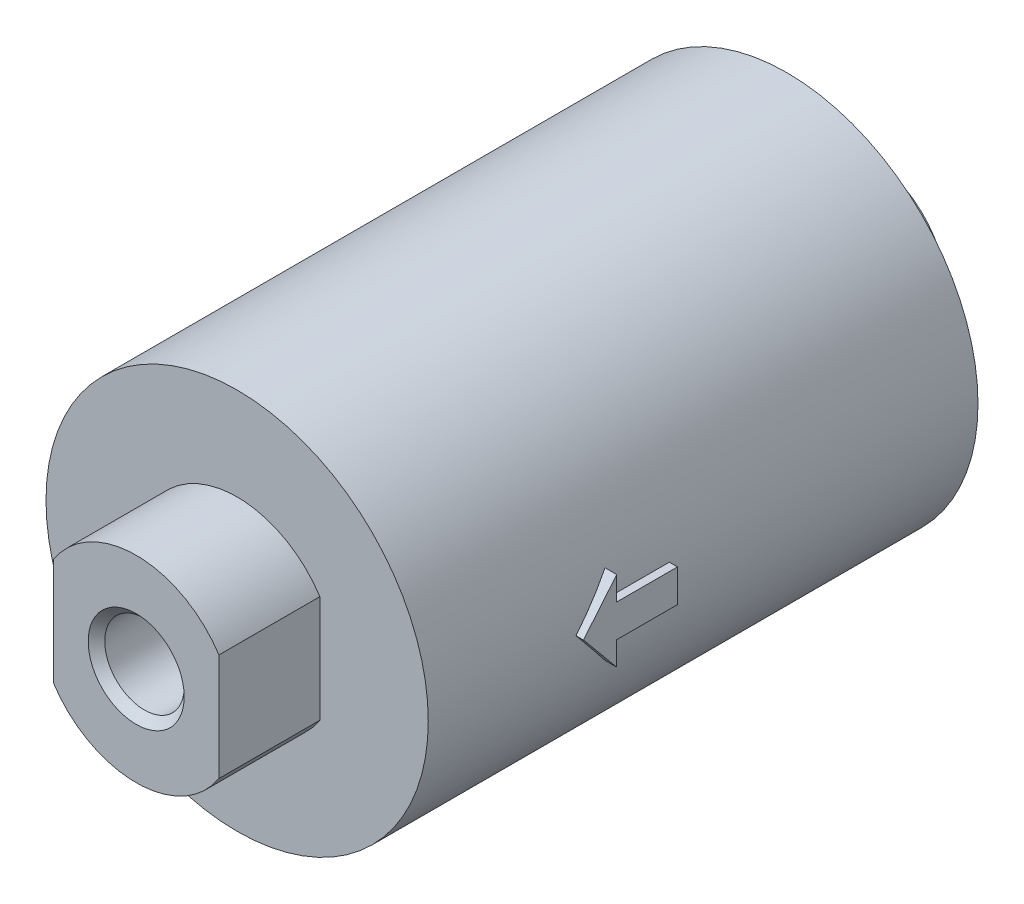
ISO-10303-21;
HEADER;
FILE_DESCRIPTION(('STEP AP214'),'2;1');
FILE_NAME('part.step','',(''),(''),'','','');
FILE_SCHEMA(('AUTOMOTIVE_DESIGN { 1 0 10303 214 1 1 1 1 }'));
ENDSEC;
DATA;
#1=APPLICATION_CONTEXT('core data for automotive mechanical design processes');
#2=APPLICATION_PROTOCOL_DEFINITION('international standard','automotive_design',2000,#1);
#3=PRODUCT_CONTEXT('',#1,'mechanical');
#4=PRODUCT('Part','Part','',(#3));
#5=PRODUCT_RELATED_PRODUCT_CATEGORY('part','',(#4));
#6=PRODUCT_DEFINITION_FORMATION('','',#4);
#7=PRODUCT_DEFINITION_CONTEXT('part definition',#1,'design');
#8=PRODUCT_DEFINITION('design','',#6,#7);
#9=PRODUCT_DEFINITION_SHAPE('','',#8);
#10=(LENGTH_UNIT() NAMED_UNIT(*) SI_UNIT(.MILLI.,.METRE.));
#11=(NAMED_UNIT(*) PLANE_ANGLE_UNIT() SI_UNIT($,.RADIAN.));
#12=(NAMED_UNIT(*) SI_UNIT($,.STERADIAN.) SOLID_ANGLE_UNIT());
#13=UNCERTAINTY_MEASURE_WITH_UNIT(LENGTH_MEASURE(1.E-05),#10,'distance_accuracy_value','');
#14=(GEOMETRIC_REPRESENTATION_CONTEXT(3) GLOBAL_UNCERTAINTY_ASSIGNED_CONTEXT((#13)) GLOBAL_UNIT_ASSIGNED_CONTEXT((#10,
#11,#12)) REPRESENTATION_CONTEXT('',''));
#15=CARTESIAN_POINT('',(0.,0.,0.));
#16=DIRECTION('',(0.,0.,1.));
#17=DIRECTION('',(1.,0.,0.));
#18=AXIS2_PLACEMENT_3D('',#15,#16,#17);
#19=CARTESIAN_POINT('',(0.,0.,33.22));
#20=DIRECTION('',(0.,0.,-1.));
#21=DIRECTION('',(-1.,0.,0.));
#22=AXIS2_PLACEMENT_3D('',#19,#20,#21);
#23=CYLINDRICAL_SURFACE('',#22,11.55);
#24=DIRECTION('',(0.,0.,-1.));
#25=VECTOR('',#24,1.);
#26=CARTESIAN_POINT('',(11.5077416225927,-0.987108275544267,33.22));
#27=LINE('',#26,#25);
#28=CARTESIAN_POINT('',(11.5077416225927,-0.987108275544265,22.2814362241046));
#29=VERTEX_POINT('',#28);
#30=CARTESIAN_POINT('',(11.5077416225927,-0.987108275544267,18.6076522502652));
#31=VERTEX_POINT('',#30);
#32=EDGE_CURVE('E201',#29,#31,#27,.T.);
#33=ORIENTED_EDGE('',*,*,#32,.F.);
#34=CARTESIAN_POINT('',(0.,0.,22.2814362241046));
#35=DIRECTION('',(0.,0.,-1.));
#36=DIRECTION('',(-1.,0.,0.));
#37=AXIS2_PLACEMENT_3D('',#34,#35,#36);
#38=CIRCLE('',#37,11.55);
#39=CARTESIAN_POINT('',(11.293008689635,-2.42290213088133,22.2814362241046));
#40=VERTEX_POINT('',#39);
#41=EDGE_CURVE('E190',#40,#29,#38,.F.);
#42=ORIENTED_EDGE('',*,*,#41,.F.);
#43=CARTESIAN_POINT('',(0.,0.,24.2915476215765));
#44=DIRECTION('',(0.,-0.638500632437374,0.769621298027201));
#45=DIRECTION('',(0.,-0.769621298027201,-0.638500632437374));
#46=AXIS2_PLACEMENT_3D('',#43,#44,#45);
#47=ELLIPSE('',#46,15.0073809412584,11.55);
#48=CARTESIAN_POINT('',(11.55,0.,24.2915476215765));
#49=VERTEX_POINT('',#48);
#50=EDGE_CURVE('E156',#49,#40,#47,.F.);
#51=ORIENTED_EDGE('',*,*,#50,.F.);
#52=CARTESIAN_POINT('',(0.,0.,24.2915476215765));
#53=DIRECTION('',(0.,0.638500632437374,0.769621298027201));
#54=DIRECTION('',(0.,0.769621298027201,-0.638500632437374));
#55=AXIS2_PLACEMENT_3D('',#52,#53,#54);
#56=ELLIPSE('',#55,15.0073809412584,11.55);
#57=CARTESIAN_POINT('',(11.293008689635,2.42290213088133,22.2814362241046));
#58=VERTEX_POINT('',#57);
#59=EDGE_CURVE('E57',#58,#49,#56,.F.);
#60=ORIENTED_EDGE('',*,*,#59,.F.);
#61=CARTESIAN_POINT('',(0.,0.,22.2814362241046));
#62=DIRECTION('',(0.,0.,-1.));
#63=DIRECTION('',(-1.,0.,0.));
#64=AXIS2_PLACEMENT_3D('',#61,#62,#63);
#65=CIRCLE('',#64,11.55);
#66=CARTESIAN_POINT('',(11.5077416225927,0.987108275544265,22.2814362241046));
#67=VERTEX_POINT('',#66);
#68=EDGE_CURVE('E538',#67,#58,#65,.F.);
#69=ORIENTED_EDGE('',*,*,#68,.F.);
#70=DIRECTION('',(0.,0.,-1.));
#71=VECTOR('',#70,1.);
#72=CARTESIAN_POINT('',(11.5077416225927,0.987108275544265,33.22));
#73=LINE('',#72,#71);
#74=CARTESIAN_POINT('',(11.5077416225927,0.987108275544265,18.6076522502652));
#75=VERTEX_POINT('',#74);
#76=EDGE_CURVE('E541',#75,#67,#73,.F.);
#77=ORIENTED_EDGE('',*,*,#76,.F.);
#78=CARTESIAN_POINT('',(0.,0.,18.6076522502652));
#79=DIRECTION('',(0.,0.,-1.));
#80=DIRECTION('',(-1.,0.,0.));
#81=AXIS2_PLACEMENT_3D('',#78,#79,#80);
#82=CIRCLE('',#81,11.55);
#83=EDGE_CURVE('E545',#31,#75,#82,.F.);
#84=ORIENTED_EDGE('',*,*,#83,.F.);
#85=EDGE_LOOP('',(#33,#42,#51,#60,#69,#77,#84));
#86=FACE_BOUND('',#85,.T.);
#87=CARTESIAN_POINT('',(0.,0.,33.22));
#88=DIRECTION('',(0.,0.,1.));
#89=DIRECTION('',(1.,0.,0.));
#90=AXIS2_PLACEMENT_3D('',#87,#88,#89);
#91=CIRCLE('',#90,11.55);
#92=CARTESIAN_POINT('',(11.55,0.,33.22));
#93=VERTEX_POINT('',#92);
#94=EDGE_CURVE('E275',#93,#93,#91,.T.);
#95=ORIENTED_EDGE('',*,*,#94,.F.);
#96=EDGE_LOOP('',(#95));
#97=FACE_BOUND('',#96,.T.);
#98=CARTESIAN_POINT('',(0.,0.,0.));
#99=DIRECTION('',(0.,0.,1.));
#100=DIRECTION('',(1.,0.,0.));
#101=AXIS2_PLACEMENT_3D('',#98,#99,#100);
#102=CIRCLE('',#101,11.55);
#103=CARTESIAN_POINT('',(11.55,0.,0.));
#104=VERTEX_POINT('',#103);
#105=EDGE_CURVE('E274',#104,#104,#102,.T.);
#106=ORIENTED_EDGE('',*,*,#105,.T.);
#107=EDGE_LOOP('',(#106));
#108=FACE_BOUND('',#107,.T.);
#109=ADVANCED_FACE('F41',(#86,#97,#108),#23,.T.);
#110=CARTESIAN_POINT('',(0.,0.,33.22));
#111=DIRECTION('',(0.,0.,1.));
#112=DIRECTION('',(1.,0.,0.));
#113=AXIS2_PLACEMENT_3D('',#110,#111,#112);
#114=PLANE('',#113);
#115=CARTESIAN_POINT('',(0.,0.,33.22));
#116=DIRECTION('',(0.,0.,1.));
#117=DIRECTION('',(1.,0.,0.));
#118=AXIS2_PLACEMENT_3D('',#115,#116,#117);
#119=CIRCLE('',#118,5.955);
#120=CARTESIAN_POINT('',(5.,3.23450537176861,33.22));
#121=VERTEX_POINT('',#120);
#122=CARTESIAN_POINT('',(-5.,3.23450537176861,33.22));
#123=VERTEX_POINT('',#122);
#124=EDGE_CURVE('E241',#121,#123,#119,.T.);
#125=ORIENTED_EDGE('',*,*,#124,.F.);
#126=DIRECTION('',(0.,1.,0.));
#127=VECTOR('',#126,1.);
#128=CARTESIAN_POINT('',(5.,3.23450537176861,33.22));
#129=LINE('',#128,#127);
#130=CARTESIAN_POINT('',(5.,-3.23450537176861,33.22));
#131=VERTEX_POINT('',#130);
#132=EDGE_CURVE('E246',#131,#121,#129,.T.);
#133=ORIENTED_EDGE('',*,*,#132,.F.);
#134=CARTESIAN_POINT('',(0.,0.,33.22));
#135=DIRECTION('',(0.,0.,1.));
#136=DIRECTION('',(1.,0.,0.));
#137=AXIS2_PLACEMENT_3D('',#134,#135,#136);
#138=CIRCLE('',#137,5.955);
#139=CARTESIAN_POINT('',(-5.,-3.23450537176861,33.22));
#140=VERTEX_POINT('',#139);
#141=EDGE_CURVE('E258',#140,#131,#138,.T.);
#142=ORIENTED_EDGE('',*,*,#141,.F.);
#143=DIRECTION('',(0.,-1.,0.));
#144=VECTOR('',#143,1.);
#145=CARTESIAN_POINT('',(-5.,3.23450537176861,33.22));
#146=LINE('',#145,#144);
#147=EDGE_CURVE('E255',#123,#140,#146,.T.);
#148=ORIENTED_EDGE('',*,*,#147,.F.);
#149=EDGE_LOOP('',(#125,#133,#142,#148));
#150=FACE_BOUND('',#149,.T.);
#151=ORIENTED_EDGE('',*,*,#94,.T.);
#152=EDGE_LOOP('',(#151));
#153=FACE_BOUND('',#152,.T.);
#154=ADVANCED_FACE('F302',(#150,#153),#114,.T.);
#155=CARTESIAN_POINT('',(0.,0.,0.));
#156=DIRECTION('',(0.,0.,1.));
#157=DIRECTION('',(1.,0.,0.));
#158=AXIS2_PLACEMENT_3D('',#155,#156,#157);
#159=PLANE('',#158);
#160=CARTESIAN_POINT('',(0.,0.,0.));
#161=DIRECTION('',(0.,0.,-1.));
#162=DIRECTION('',(-1.,0.,0.));
#163=AXIS2_PLACEMENT_3D('',#160,#161,#162);
#164=CIRCLE('',#163,5.);
#165=CARTESIAN_POINT('',(-4.5,2.17944947177034,0.));
#166=VERTEX_POINT('',#165);
#167=CARTESIAN_POINT('',(4.5,2.17944947177034,0.));
#168=VERTEX_POINT('',#167);
#169=EDGE_CURVE('E205',#166,#168,#164,.T.);
#170=ORIENTED_EDGE('',*,*,#169,.F.);
#171=DIRECTION('',(0.,1.,0.));
#172=VECTOR('',#171,1.);
#173=CARTESIAN_POINT('',(-4.5,2.17944947177034,0.));
#174=LINE('',#173,#172);
#175=CARTESIAN_POINT('',(-4.5,-2.17944947177034,0.));
#176=VERTEX_POINT('',#175);
#177=EDGE_CURVE('E213',#176,#166,#174,.T.);
#178=ORIENTED_EDGE('',*,*,#177,.F.);
#179=CARTESIAN_POINT('',(0.,0.,0.));
#180=DIRECTION('',(0.,0.,-1.));
#181=DIRECTION('',(-1.,0.,0.));
#182=AXIS2_PLACEMENT_3D('',#179,#180,#181);
#183=CIRCLE('',#182,5.);
#184=CARTESIAN_POINT('',(4.5,-2.17944947177034,0.));
#185=VERTEX_POINT('',#184);
#186=EDGE_CURVE('E223',#185,#176,#183,.T.);
#187=ORIENTED_EDGE('',*,*,#186,.F.);
#188=DIRECTION('',(0.,-1.,0.));
#189=VECTOR('',#188,1.);
#190=CARTESIAN_POINT('',(4.5,2.17944947177034,0.));
#191=LINE('',#190,#189);
#192=EDGE_CURVE('E65',#168,#185,#191,.T.);
#193=ORIENTED_EDGE('',*,*,#192,.F.);
#194=EDGE_LOOP('',(#170,#178,#187,#193));
#195=FACE_BOUND('',#194,.T.);
#196=ORIENTED_EDGE('',*,*,#105,.F.);
#197=EDGE_LOOP('',(#196));
#198=FACE_BOUND('',#197,.T.);
#199=ADVANCED_FACE('F309',(#195,#198),#159,.F.);
#200=CARTESIAN_POINT('',(0.,0.,39.32));
#201=DIRECTION('',(0.,0.,-1.));
#202=DIRECTION('',(-1.,0.,0.));
#203=AXIS2_PLACEMENT_3D('',#200,#201,#202);
#204=CYLINDRICAL_SURFACE('',#203,5.955);
#205=ORIENTED_EDGE('',*,*,#124,.T.);
#206=DIRECTION('',(0.,0.,-1.));
#207=VECTOR('',#206,1.);
#208=CARTESIAN_POINT('',(-5.,3.23450537176861,39.32));
#209=LINE('',#208,#207);
#210=CARTESIAN_POINT('',(-5.,3.23450537176861,39.32));
#211=VERTEX_POINT('',#210);
#212=EDGE_CURVE('E271',#211,#123,#209,.T.);
#213=ORIENTED_EDGE('',*,*,#212,.F.);
#214=CARTESIAN_POINT('',(0.,0.,39.32));
#215=DIRECTION('',(0.,0.,1.));
#216=DIRECTION('',(1.,0.,0.));
#217=AXIS2_PLACEMENT_3D('',#214,#215,#216);
#218=CIRCLE('',#217,5.955);
#219=CARTESIAN_POINT('',(5.,3.23450537176861,39.32));
#220=VERTEX_POINT('',#219);
#221=EDGE_CURVE('E242',#220,#211,#218,.T.);
#222=ORIENTED_EDGE('',*,*,#221,.F.);
#223=DIRECTION('',(0.,0.,-1.));
#224=VECTOR('',#223,1.);
#225=CARTESIAN_POINT('',(5.,3.23450537176861,39.32));
#226=LINE('',#225,#224);
#227=EDGE_CURVE('E252',#220,#121,#226,.T.);
#228=ORIENTED_EDGE('',*,*,#227,.T.);
#229=EDGE_LOOP('',(#205,#213,#222,#228));
#230=FACE_BOUND('',#229,.T.);
#231=ADVANCED_FACE('F315',(#230),#204,.T.);
#232=CARTESIAN_POINT('',(-5.,3.23450537176861,39.32));
#233=DIRECTION('',(1.,0.,0.));
#234=DIRECTION('',(0.,0.,-1.));
#235=AXIS2_PLACEMENT_3D('',#232,#233,#234);
#236=PLANE('',#235);
#237=ORIENTED_EDGE('',*,*,#147,.T.);
#238=DIRECTION('',(0.,0.,-1.));
#239=VECTOR('',#238,1.);
#240=CARTESIAN_POINT('',(-5.,-3.23450537176861,39.32));
#241=LINE('',#240,#239);
#242=CARTESIAN_POINT('',(-5.,-3.23450537176861,39.32));
#243=VERTEX_POINT('',#242);
#244=EDGE_CURVE('E268',#243,#140,#241,.T.);
#245=ORIENTED_EDGE('',*,*,#244,.F.);
#246=DIRECTION('',(0.,-1.,0.));
#247=VECTOR('',#246,1.);
#248=CARTESIAN_POINT('',(-5.,3.23450537176861,39.32));
#249=LINE('',#248,#247);
#250=EDGE_CURVE('E245',#211,#243,#249,.T.);
#251=ORIENTED_EDGE('',*,*,#250,.F.);
#252=ORIENTED_EDGE('',*,*,#212,.T.);
#253=EDGE_LOOP('',(#237,#245,#251,#252));
#254=FACE_BOUND('',#253,.T.);
#255=ADVANCED_FACE('F320',(#254),#236,.F.);
#256=CARTESIAN_POINT('',(0.,0.,39.32));
#257=DIRECTION('',(0.,0.,-1.));
#258=DIRECTION('',(-1.,0.,0.));
#259=AXIS2_PLACEMENT_3D('',#256,#257,#258);
#260=CYLINDRICAL_SURFACE('',#259,5.955);
#261=ORIENTED_EDGE('',*,*,#141,.T.);
#262=DIRECTION('',(0.,0.,-1.));
#263=VECTOR('',#262,1.);
#264=CARTESIAN_POINT('',(5.,-3.23450537176861,39.32));
#265=LINE('',#264,#263);
#266=CARTESIAN_POINT('',(5.,-3.23450537176861,39.32));
#267=VERTEX_POINT('',#266);
#268=EDGE_CURVE('E265',#267,#131,#265,.T.);
#269=ORIENTED_EDGE('',*,*,#268,.F.);
#270=CARTESIAN_POINT('',(0.,0.,39.32));
#271=DIRECTION('',(0.,0.,1.));
#272=DIRECTION('',(1.,0.,0.));
#273=AXIS2_PLACEMENT_3D('',#270,#271,#272);
#274=CIRCLE('',#273,5.955);
#275=EDGE_CURVE('E248',#243,#267,#274,.T.);
#276=ORIENTED_EDGE('',*,*,#275,.F.);
#277=ORIENTED_EDGE('',*,*,#244,.T.);
#278=EDGE_LOOP('',(#261,#269,#276,#277));
#279=FACE_BOUND('',#278,.T.);
#280=ADVANCED_FACE('F324',(#279),#260,.T.);
#281=CARTESIAN_POINT('',(5.,3.23450537176861,39.32));
#282=DIRECTION('',(-1.,0.,0.));
#283=DIRECTION('',(0.,0.,1.));
#284=AXIS2_PLACEMENT_3D('',#281,#282,#283);
#285=PLANE('',#284);
#286=ORIENTED_EDGE('',*,*,#132,.T.);
#287=ORIENTED_EDGE('',*,*,#227,.F.);
#288=DIRECTION('',(0.,1.,0.));
#289=VECTOR('',#288,1.);
#290=CARTESIAN_POINT('',(5.,3.23450537176861,39.32));
#291=LINE('',#290,#289);
#292=EDGE_CURVE('E250',#267,#220,#291,.T.);
#293=ORIENTED_EDGE('',*,*,#292,.F.);
#294=ORIENTED_EDGE('',*,*,#268,.T.);
#295=EDGE_LOOP('',(#286,#287,#293,#294));
#296=FACE_BOUND('',#295,.T.);
#297=ADVANCED_FACE('F328',(#296),#285,.F.);
#298=CARTESIAN_POINT('',(0.,0.,39.32));
#299=DIRECTION('',(0.,0.,1.));
#300=DIRECTION('',(1.,0.,0.));
#301=AXIS2_PLACEMENT_3D('',#298,#299,#300);
#302=PLANE('',#301);
#303=CARTESIAN_POINT('',(0.,0.,39.32));
#304=DIRECTION('',(0.,0.,1.));
#305=DIRECTION('',(1.,0.,0.));
#306=AXIS2_PLACEMENT_3D('',#303,#304,#305);
#307=CIRCLE('',#306,2.90000000000002);
#308=CARTESIAN_POINT('',(2.90000000000002,0.,39.32));
#309=VERTEX_POINT('',#308);
#310=EDGE_CURVE('E11',#309,#309,#307,.F.);
#311=ORIENTED_EDGE('',*,*,#310,.T.);
#312=EDGE_LOOP('',(#311));
#313=FACE_BOUND('',#312,.T.);
#314=ORIENTED_EDGE('',*,*,#221,.T.);
#315=ORIENTED_EDGE('',*,*,#250,.T.);
#316=ORIENTED_EDGE('',*,*,#275,.T.);
#317=ORIENTED_EDGE('',*,*,#292,.T.);
#318=EDGE_LOOP('',(#314,#315,#316,#317));
#319=FACE_BOUND('',#318,.T.);
#320=ADVANCED_FACE('F332',(#313,#319),#302,.T.);
#321=CARTESIAN_POINT('',(0.,0.,31.02));
#322=DIRECTION('',(0.,0.,1.));
#323=DIRECTION('',(1.,0.,0.));
#324=AXIS2_PLACEMENT_3D('',#321,#322,#323);
#325=CYLINDRICAL_SURFACE('',#324,2.4);
#326=CARTESIAN_POINT('',(0.,0.,38.82));
#327=DIRECTION('',(0.,0.,1.));
#328=DIRECTION('',(1.,0.,0.));
#329=AXIS2_PLACEMENT_3D('',#326,#327,#328);
#330=CIRCLE('',#329,2.4);
#331=CARTESIAN_POINT('',(2.4,0.,38.82));
#332=VERTEX_POINT('',#331);
#333=EDGE_CURVE('E50',#332,#332,#330,.T.);
#334=ORIENTED_EDGE('',*,*,#333,.T.);
#335=EDGE_LOOP('',(#334));
#336=FACE_BOUND('',#335,.T.);
#337=CARTESIAN_POINT('',(0.,0.,31.02));
#338=DIRECTION('',(0.,0.,1.));
#339=DIRECTION('',(1.,0.,0.));
#340=AXIS2_PLACEMENT_3D('',#337,#338,#339);
#341=CIRCLE('',#340,2.4);
#342=CARTESIAN_POINT('',(2.4,0.,31.02));
#343=VERTEX_POINT('',#342);
#344=EDGE_CURVE('E238',#343,#343,#341,.T.);
#345=ORIENTED_EDGE('',*,*,#344,.F.);
#346=EDGE_LOOP('',(#345));
#347=FACE_BOUND('',#346,.T.);
#348=ADVANCED_FACE('F282',(#336,#347),#325,.F.);
#349=CARTESIAN_POINT('',(0.,0.,31.02));
#350=DIRECTION('',(0.,0.,1.));
#351=DIRECTION('',(1.,0.,0.));
#352=AXIS2_PLACEMENT_3D('',#349,#350,#351);
#353=PLANE('',#352);
#354=ORIENTED_EDGE('',*,*,#344,.T.);
#355=EDGE_LOOP('',(#354));
#356=FACE_BOUND('',#355,.T.);
#357=ADVANCED_FACE('F287',(#356),#353,.T.);
#358=CARTESIAN_POINT('',(0.,0.,38.82));
#359=DIRECTION('',(0.,0.,1.));
#360=DIRECTION('',(1.,0.,0.));
#361=AXIS2_PLACEMENT_3D('',#358,#359,#360);
#362=CONICAL_SURFACE('',#361,2.4,0.785398163397441);
#363=ORIENTED_EDGE('',*,*,#310,.F.);
#364=EDGE_LOOP('',(#363));
#365=FACE_BOUND('',#364,.T.);
#366=ORIENTED_EDGE('',*,*,#333,.F.);
#367=EDGE_LOOP('',(#366));
#368=FACE_BOUND('',#367,.T.);
#369=ADVANCED_FACE('F44',(#365,#368),#362,.F.);
#370=CARTESIAN_POINT('',(0.,0.,-4.7));
#371=DIRECTION('',(0.,0.,-1.));
#372=DIRECTION('',(-1.,0.,0.));
#373=AXIS2_PLACEMENT_3D('',#370,#371,#372);
#374=PLANE('',#373);
#375=CARTESIAN_POINT('',(0.,0.,-4.7));
#376=DIRECTION('',(0.,0.,-1.));
#377=DIRECTION('',(-1.,0.,0.));
#378=AXIS2_PLACEMENT_3D('',#375,#376,#377);
#379=CIRCLE('',#378,5.);
#380=CARTESIAN_POINT('',(-4.5,2.17944947177034,-4.7));
#381=VERTEX_POINT('',#380);
#382=CARTESIAN_POINT('',(4.5,2.17944947177034,-4.7));
#383=VERTEX_POINT('',#382);
#384=EDGE_CURVE('E209',#381,#383,#379,.T.);
#385=ORIENTED_EDGE('',*,*,#384,.T.);
#386=DIRECTION('',(0.,-1.,0.));
#387=VECTOR('',#386,1.);
#388=CARTESIAN_POINT('',(4.5,2.17944947177034,-4.7));
#389=LINE('',#388,#387);
#390=CARTESIAN_POINT('',(4.5,-2.17944947177034,-4.7));
#391=VERTEX_POINT('',#390);
#392=EDGE_CURVE('E212',#383,#391,#389,.T.);
#393=ORIENTED_EDGE('',*,*,#392,.T.);
#394=CARTESIAN_POINT('',(0.,0.,-4.7));
#395=DIRECTION('',(0.,0.,-1.));
#396=DIRECTION('',(-1.,0.,0.));
#397=AXIS2_PLACEMENT_3D('',#394,#395,#396);
#398=CIRCLE('',#397,5.);
#399=CARTESIAN_POINT('',(-4.5,-2.17944947177034,-4.7));
#400=VERTEX_POINT('',#399);
#401=EDGE_CURVE('E215',#391,#400,#398,.T.);
#402=ORIENTED_EDGE('',*,*,#401,.T.);
#403=DIRECTION('',(0.,1.,0.));
#404=VECTOR('',#403,1.);
#405=CARTESIAN_POINT('',(-4.5,2.17944947177034,-4.7));
#406=LINE('',#405,#404);
#407=EDGE_CURVE('E217',#400,#381,#406,.T.);
#408=ORIENTED_EDGE('',*,*,#407,.T.);
#409=EDGE_LOOP('',(#385,#393,#402,#408));
#410=FACE_BOUND('',#409,.T.);
#411=CARTESIAN_POINT('',(0.,0.,-4.7));
#412=DIRECTION('',(0.,0.,-1.));
#413=DIRECTION('',(-1.,0.,0.));
#414=AXIS2_PLACEMENT_3D('',#411,#412,#413);
#415=CIRCLE('',#414,2.45);
#416=CARTESIAN_POINT('',(-2.45,0.,-4.7));
#417=VERTEX_POINT('',#416);
#418=EDGE_CURVE('E202',#417,#417,#415,.T.);
#419=ORIENTED_EDGE('',*,*,#418,.F.);
#420=EDGE_LOOP('',(#419));
#421=FACE_BOUND('',#420,.T.);
#422=ADVANCED_FACE('F286',(#410,#421),#374,.T.);
#423=CARTESIAN_POINT('',(0.,0.,-4.7));
#424=DIRECTION('',(0.,0.,1.));
#425=DIRECTION('',(1.,0.,0.));
#426=AXIS2_PLACEMENT_3D('',#423,#424,#425);
#427=CYLINDRICAL_SURFACE('',#426,5.);
#428=ORIENTED_EDGE('',*,*,#169,.T.);
#429=DIRECTION('',(0.,0.,1.));
#430=VECTOR('',#429,1.);
#431=CARTESIAN_POINT('',(4.5,2.17944947177034,-4.7));
#432=LINE('',#431,#430);
#433=EDGE_CURVE('E236',#383,#168,#432,.T.);
#434=ORIENTED_EDGE('',*,*,#433,.F.);
#435=ORIENTED_EDGE('',*,*,#384,.F.);
#436=DIRECTION('',(0.,0.,1.));
#437=VECTOR('',#436,1.);
#438=CARTESIAN_POINT('',(-4.5,2.17944947177034,-4.7));
#439=LINE('',#438,#437);
#440=EDGE_CURVE('E219',#381,#166,#439,.T.);
#441=ORIENTED_EDGE('',*,*,#440,.T.);
#442=EDGE_LOOP('',(#428,#434,#435,#441));
#443=FACE_BOUND('',#442,.T.);
#444=ADVANCED_FACE('F294',(#443),#427,.T.);
#445=CARTESIAN_POINT('',(4.5,2.17944947177034,-4.7));
#446=DIRECTION('',(-1.,0.,0.));
#447=DIRECTION('',(0.,0.,1.));
#448=AXIS2_PLACEMENT_3D('',#445,#446,#447);
#449=PLANE('',#448);
#450=ORIENTED_EDGE('',*,*,#192,.T.);
#451=DIRECTION('',(0.,0.,1.));
#452=VECTOR('',#451,1.);
#453=CARTESIAN_POINT('',(4.5,-2.17944947177034,-4.7));
#454=LINE('',#453,#452);
#455=EDGE_CURVE('E233',#391,#185,#454,.T.);
#456=ORIENTED_EDGE('',*,*,#455,.F.);
#457=ORIENTED_EDGE('',*,*,#392,.F.);
#458=ORIENTED_EDGE('',*,*,#433,.T.);
#459=EDGE_LOOP('',(#450,#456,#457,#458));
#460=FACE_BOUND('',#459,.T.);
#461=ADVANCED_FACE('F340',(#460),#449,.F.);
#462=CARTESIAN_POINT('',(0.,0.,-4.7));
#463=DIRECTION('',(0.,0.,1.));
#464=DIRECTION('',(1.,0.,0.));
#465=AXIS2_PLACEMENT_3D('',#462,#463,#464);
#466=CYLINDRICAL_SURFACE('',#465,5.);
#467=ORIENTED_EDGE('',*,*,#186,.T.);
#468=DIRECTION('',(0.,0.,1.));
#469=VECTOR('',#468,1.);
#470=CARTESIAN_POINT('',(-4.5,-2.17944947177034,-4.7));
#471=LINE('',#470,#469);
#472=EDGE_CURVE('E230',#400,#176,#471,.T.);
#473=ORIENTED_EDGE('',*,*,#472,.F.);
#474=ORIENTED_EDGE('',*,*,#401,.F.);
#475=ORIENTED_EDGE('',*,*,#455,.T.);
#476=EDGE_LOOP('',(#467,#473,#474,#475));
#477=FACE_BOUND('',#476,.T.);
#478=ADVANCED_FACE('F344',(#477),#466,.T.);
#479=CARTESIAN_POINT('',(-4.5,2.17944947177034,-4.7));
#480=DIRECTION('',(1.,0.,0.));
#481=DIRECTION('',(0.,0.,-1.));
#482=AXIS2_PLACEMENT_3D('',#479,#480,#481);
#483=PLANE('',#482);
#484=ORIENTED_EDGE('',*,*,#177,.T.);
#485=ORIENTED_EDGE('',*,*,#440,.F.);
#486=ORIENTED_EDGE('',*,*,#407,.F.);
#487=ORIENTED_EDGE('',*,*,#472,.T.);
#488=EDGE_LOOP('',(#484,#485,#486,#487));
#489=FACE_BOUND('',#488,.T.);
#490=ADVANCED_FACE('F348',(#489),#483,.F.);
#491=CARTESIAN_POINT('',(0.,0.,-4.7));
#492=DIRECTION('',(0.,0.,1.));
#493=DIRECTION('',(1.,0.,0.));
#494=AXIS2_PLACEMENT_3D('',#491,#492,#493);
#495=CYLINDRICAL_SURFACE('',#494,2.45);
#496=ORIENTED_EDGE('',*,*,#418,.T.);
#497=EDGE_LOOP('',(#496));
#498=FACE_BOUND('',#497,.T.);
#499=CARTESIAN_POINT('',(0.,0.,0.));
#500=DIRECTION('',(0.,0.,-1.));
#501=DIRECTION('',(-1.,0.,0.));
#502=AXIS2_PLACEMENT_3D('',#499,#500,#501);
#503=CIRCLE('',#502,2.45);
#504=CARTESIAN_POINT('',(-2.45,0.,0.));
#505=VERTEX_POINT('',#504);
#506=EDGE_CURVE('E206',#505,#505,#503,.T.);
#507=ORIENTED_EDGE('',*,*,#506,.F.);
#508=EDGE_LOOP('',(#507));
#509=FACE_BOUND('',#508,.T.);
#510=ADVANCED_FACE('F351',(#498,#509),#495,.F.);
#511=ORIENTED_EDGE('',*,*,#506,.T.);
#512=EDGE_LOOP('',(#511));
#513=FACE_BOUND('',#512,.T.);
#514=ADVANCED_FACE('F316',(#513),#159,.F.);
#515=CARTESIAN_POINT('',(12.,0.,0.));
#516=DIRECTION('',(1.,0.,0.));
#517=DIRECTION('',(0.,0.,-1.));
#518=AXIS2_PLACEMENT_3D('',#515,#516,#517);
#519=PLANE('',#518);
#520=DIRECTION('',(0.,-0.769621298027201,-0.638500632437374));
#521=VECTOR('',#520,1.);
#522=CARTESIAN_POINT('',(12.,0.,24.2915476215765));
#523=LINE('',#522,#521);
#524=CARTESIAN_POINT('',(12.,0.,24.2915476215765));
#525=VERTEX_POINT('',#524);
#526=CARTESIAN_POINT('',(12.,-2.42290213088133,22.2814362241046));
#527=VERTEX_POINT('',#526);
#528=EDGE_CURVE('E153',#525,#527,#523,.T.);
#529=ORIENTED_EDGE('',*,*,#528,.T.);
#530=DIRECTION('',(0.,1.,0.));
#531=VECTOR('',#530,1.);
#532=CARTESIAN_POINT('',(12.,-2.42290213088133,22.2814362241046));
#533=LINE('',#532,#531);
#534=CARTESIAN_POINT('',(12.,-0.987108275544265,22.2814362241046));
#535=VERTEX_POINT('',#534);
#536=EDGE_CURVE('E164',#527,#535,#533,.T.);
#537=ORIENTED_EDGE('',*,*,#536,.T.);
#538=DIRECTION('',(0.,0.,-1.));
#539=VECTOR('',#538,1.);
#540=CARTESIAN_POINT('',(12.,-0.987108275544265,22.2814362241046));
#541=LINE('',#540,#539);
#542=CARTESIAN_POINT('',(12.,-0.987108275544264,18.6076522502652));
#543=VERTEX_POINT('',#542);
#544=EDGE_CURVE('E169',#535,#543,#541,.T.);
#545=ORIENTED_EDGE('',*,*,#544,.T.);
#546=DIRECTION('',(0.,1.,0.));
#547=VECTOR('',#546,1.);
#548=CARTESIAN_POINT('',(12.,0.987108275544265,18.6076522502652));
#549=LINE('',#548,#547);
#550=CARTESIAN_POINT('',(12.,0.987108275544265,18.6076522502652));
#551=VERTEX_POINT('',#550);
#552=EDGE_CURVE('E179',#543,#551,#549,.T.);
#553=ORIENTED_EDGE('',*,*,#552,.T.);
#554=DIRECTION('',(0.,0.,1.));
#555=VECTOR('',#554,1.);
#556=CARTESIAN_POINT('',(12.,0.987108275544265,22.2814362241046));
#557=LINE('',#556,#555);
#558=CARTESIAN_POINT('',(12.,0.987108275544265,22.2814362241046));
#559=VERTEX_POINT('',#558);
#560=EDGE_CURVE('E182',#551,#559,#557,.T.);
#561=ORIENTED_EDGE('',*,*,#560,.T.);
#562=DIRECTION('',(0.,1.,0.));
#563=VECTOR('',#562,1.);
#564=CARTESIAN_POINT('',(12.,2.42290213088133,22.2814362241046));
#565=LINE('',#564,#563);
#566=CARTESIAN_POINT('',(12.,2.42290213088133,22.2814362241046));
#567=VERTEX_POINT('',#566);
#568=EDGE_CURVE('E185',#559,#567,#565,.T.);
#569=ORIENTED_EDGE('',*,*,#568,.T.);
#570=DIRECTION('',(0.,-0.769621298027201,0.638500632437374));
#571=VECTOR('',#570,1.);
#572=CARTESIAN_POINT('',(12.,0.,24.2915476215765));
#573=LINE('',#572,#571);
#574=EDGE_CURVE('E161',#567,#525,#573,.T.);
#575=ORIENTED_EDGE('',*,*,#574,.T.);
#576=EDGE_LOOP('',(#529,#537,#545,#553,#561,#569,#575));
#577=FACE_BOUND('',#576,.T.);
#578=ADVANCED_FACE('F171',(#577),#519,.T.);
#579=CARTESIAN_POINT('',(-11.551,-2.42290213088133,22.2814362241046));
#580=DIRECTION('',(0.,0.,-1.));
#581=DIRECTION('',(-1.,0.,0.));
#582=AXIS2_PLACEMENT_3D('',#579,#580,#581);
#583=PLANE('',#582);
#584=DIRECTION('',(1.,0.,0.));
#585=VECTOR('',#584,1.);
#586=CARTESIAN_POINT('',(-11.551,-2.42290213088133,22.2814362241046));
#587=LINE('',#586,#585);
#588=EDGE_CURVE('E149',#40,#527,#587,.T.);
#589=ORIENTED_EDGE('',*,*,#588,.F.);
#590=ORIENTED_EDGE('',*,*,#41,.T.);
#591=DIRECTION('',(1.,0.,0.));
#592=VECTOR('',#591,1.);
#593=CARTESIAN_POINT('',(-11.551,-0.987108275544265,22.2814362241046));
#594=LINE('',#593,#592);
#595=EDGE_CURVE('E160',#29,#535,#594,.T.);
#596=ORIENTED_EDGE('',*,*,#595,.T.);
#597=ORIENTED_EDGE('',*,*,#536,.F.);
#598=EDGE_LOOP('',(#589,#590,#596,#597));
#599=FACE_BOUND('',#598,.T.);
#600=ADVANCED_FACE('F165',(#599),#583,.T.);
#601=CARTESIAN_POINT('',(-11.551,-0.987108275544265,22.2814362241046));
#602=DIRECTION('',(0.,-1.,0.));
#603=DIRECTION('',(0.,0.,-1.));
#604=AXIS2_PLACEMENT_3D('',#601,#602,#603);
#605=PLANE('',#604);
#606=ORIENTED_EDGE('',*,*,#595,.F.);
#607=ORIENTED_EDGE('',*,*,#32,.T.);
#608=DIRECTION('',(1.,0.,0.));
#609=VECTOR('',#608,1.);
#610=CARTESIAN_POINT('',(-11.551,-0.987108275544264,18.6076522502652));
#611=LINE('',#610,#609);
#612=EDGE_CURVE('E197',#31,#543,#611,.T.);
#613=ORIENTED_EDGE('',*,*,#612,.T.);
#614=ORIENTED_EDGE('',*,*,#544,.F.);
#615=EDGE_LOOP('',(#606,#607,#613,#614));
#616=FACE_BOUND('',#615,.T.);
#617=ADVANCED_FACE('F362',(#616),#605,.T.);
#618=CARTESIAN_POINT('',(-11.551,0.987108275544265,18.6076522502652));
#619=DIRECTION('',(0.,0.,-1.));
#620=DIRECTION('',(-1.,0.,0.));
#621=AXIS2_PLACEMENT_3D('',#618,#619,#620);
#622=PLANE('',#621);
#623=ORIENTED_EDGE('',*,*,#612,.F.);
#624=ORIENTED_EDGE('',*,*,#83,.T.);
#625=DIRECTION('',(1.,0.,0.));
#626=VECTOR('',#625,1.);
#627=CARTESIAN_POINT('',(-11.551,0.987108275544265,18.6076522502652));
#628=LINE('',#627,#626);
#629=EDGE_CURVE('E195',#75,#551,#628,.T.);
#630=ORIENTED_EDGE('',*,*,#629,.T.);
#631=ORIENTED_EDGE('',*,*,#552,.F.);
#632=EDGE_LOOP('',(#623,#624,#630,#631));
#633=FACE_BOUND('',#632,.T.);
#634=ADVANCED_FACE('F365',(#633),#622,.T.);
#635=CARTESIAN_POINT('',(-11.551,0.987108275544265,22.2814362241046));
#636=DIRECTION('',(0.,1.,0.));
#637=DIRECTION('',(0.,0.,1.));
#638=AXIS2_PLACEMENT_3D('',#635,#636,#637);
#639=PLANE('',#638);
#640=ORIENTED_EDGE('',*,*,#629,.F.);
#641=ORIENTED_EDGE('',*,*,#76,.T.);
#642=DIRECTION('',(1.,0.,0.));
#643=VECTOR('',#642,1.);
#644=CARTESIAN_POINT('',(-11.551,0.987108275544265,22.2814362241046));
#645=LINE('',#644,#643);
#646=EDGE_CURVE('E193',#67,#559,#645,.T.);
#647=ORIENTED_EDGE('',*,*,#646,.T.);
#648=ORIENTED_EDGE('',*,*,#560,.F.);
#649=EDGE_LOOP('',(#640,#641,#647,#648));
#650=FACE_BOUND('',#649,.T.);
#651=ADVANCED_FACE('F369',(#650),#639,.T.);
#652=CARTESIAN_POINT('',(-11.551,2.42290213088133,22.2814362241046));
#653=DIRECTION('',(0.,0.,-1.));
#654=DIRECTION('',(-1.,0.,0.));
#655=AXIS2_PLACEMENT_3D('',#652,#653,#654);
#656=PLANE('',#655);
#657=ORIENTED_EDGE('',*,*,#646,.F.);
#658=ORIENTED_EDGE('',*,*,#68,.T.);
#659=DIRECTION('',(1.,0.,0.));
#660=VECTOR('',#659,1.);
#661=CARTESIAN_POINT('',(-11.551,2.42290213088133,22.2814362241046));
#662=LINE('',#661,#660);
#663=EDGE_CURVE('E191',#58,#567,#662,.T.);
#664=ORIENTED_EDGE('',*,*,#663,.T.);
#665=ORIENTED_EDGE('',*,*,#568,.F.);
#666=EDGE_LOOP('',(#657,#658,#664,#665));
#667=FACE_BOUND('',#666,.T.);
#668=ADVANCED_FACE('F373',(#667),#656,.T.);
#669=CARTESIAN_POINT('',(-11.551,0.,24.2915476215765));
#670=DIRECTION('',(0.,0.638500632437374,0.769621298027201));
#671=DIRECTION('',(0.,-0.769621298027201,0.638500632437374));
#672=AXIS2_PLACEMENT_3D('',#669,#670,#671);
#673=PLANE('',#672);
#674=ORIENTED_EDGE('',*,*,#663,.F.);
#675=ORIENTED_EDGE('',*,*,#59,.T.);
#676=DIRECTION('',(1.,0.,0.));
#677=VECTOR('',#676,1.);
#678=CARTESIAN_POINT('',(-11.551,0.,24.2915476215765));
#679=LINE('',#678,#677);
#680=EDGE_CURVE('E188',#49,#525,#679,.T.);
#681=ORIENTED_EDGE('',*,*,#680,.T.);
#682=ORIENTED_EDGE('',*,*,#574,.F.);
#683=EDGE_LOOP('',(#674,#675,#681,#682));
#684=FACE_BOUND('',#683,.T.);
#685=ADVANCED_FACE('F359',(#684),#673,.T.);
#686=CARTESIAN_POINT('',(-11.551,0.,24.2915476215765));
#687=DIRECTION('',(0.,-0.638500632437374,0.769621298027201));
#688=DIRECTION('',(0.,-0.769621298027201,-0.638500632437374));
#689=AXIS2_PLACEMENT_3D('',#686,#687,#688);
#690=PLANE('',#689);
#691=ORIENTED_EDGE('',*,*,#680,.F.);
#692=ORIENTED_EDGE('',*,*,#50,.T.);
#693=ORIENTED_EDGE('',*,*,#588,.T.);
#694=ORIENTED_EDGE('',*,*,#528,.F.);
#695=EDGE_LOOP('',(#691,#692,#693,#694));
#696=FACE_BOUND('',#695,.T.);
#697=ADVANCED_FACE('F151',(#696),#690,.T.);
#698=CLOSED_SHELL('',(#109,#154,#199,#231,#255,#280,#297,#320,#348,#357,#369,#422,#444,#461,
#478,#490,#510,#514,#578,#600,#617,#634,#651,#668,#685,#697));
#699=MANIFOLD_SOLID_BREP('B2',#698);
#700=ADVANCED_BREP_SHAPE_REPRESENTATION('',(#18,#699),#14);
#701=SHAPE_DEFINITION_REPRESENTATION(#9,#700);
ENDSEC;
END-ISO-10303-21;
